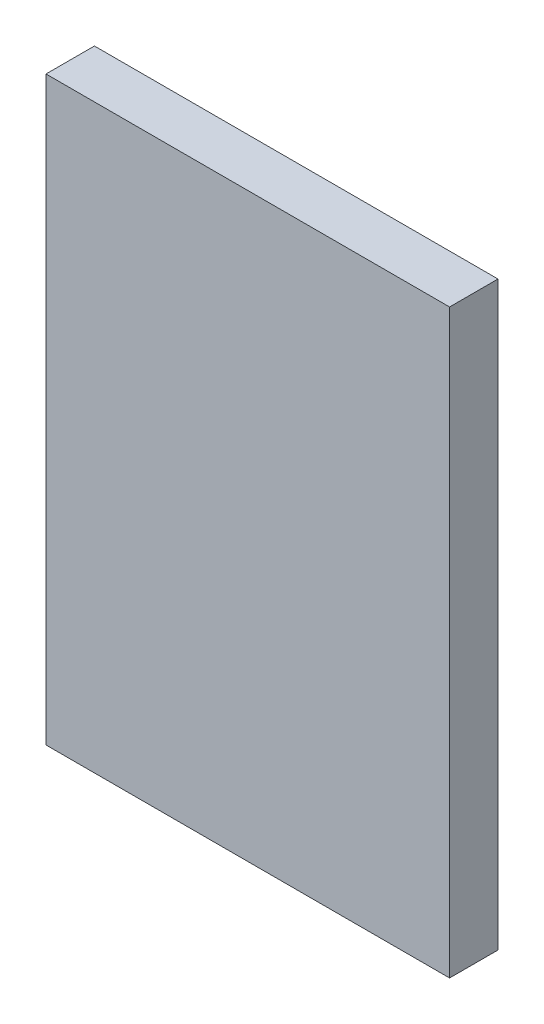
ISO-10303-21;
HEADER;
FILE_DESCRIPTION(('STEP AP214'),'2;1');
FILE_NAME('part.step','',(''),(''),'','','');
FILE_SCHEMA(('AUTOMOTIVE_DESIGN { 1 0 10303 214 1 1 1 1 }'));
ENDSEC;
DATA;
#1=APPLICATION_CONTEXT('core data for automotive mechanical design processes');
#2=APPLICATION_PROTOCOL_DEFINITION('international standard','automotive_design',2000,#1);
#3=PRODUCT_CONTEXT('',#1,'mechanical');
#4=PRODUCT('Part','Part','',(#3));
#5=PRODUCT_RELATED_PRODUCT_CATEGORY('part','',(#4));
#6=PRODUCT_DEFINITION_FORMATION('','',#4);
#7=PRODUCT_DEFINITION_CONTEXT('part definition',#1,'design');
#8=PRODUCT_DEFINITION('design','',#6,#7);
#9=PRODUCT_DEFINITION_SHAPE('','',#8);
#10=(LENGTH_UNIT() NAMED_UNIT(*) SI_UNIT(.MILLI.,.METRE.));
#11=(NAMED_UNIT(*) PLANE_ANGLE_UNIT() SI_UNIT($,.RADIAN.));
#12=(NAMED_UNIT(*) SI_UNIT($,.STERADIAN.) SOLID_ANGLE_UNIT());
#13=UNCERTAINTY_MEASURE_WITH_UNIT(LENGTH_MEASURE(1.E-05),#10,'distance_accuracy_value','');
#14=(GEOMETRIC_REPRESENTATION_CONTEXT(3) GLOBAL_UNCERTAINTY_ASSIGNED_CONTEXT((#13)) GLOBAL_UNIT_ASSIGNED_CONTEXT((#10,
#11,#12)) REPRESENTATION_CONTEXT('',''));
#15=CARTESIAN_POINT('',(0.,0.,0.));
#16=DIRECTION('',(0.,0.,1.));
#17=DIRECTION('',(1.,0.,0.));
#18=AXIS2_PLACEMENT_3D('',#15,#16,#17);
#19=CARTESIAN_POINT('',(-6.35162601626016,7.52032520325202,3.));
#20=DIRECTION('',(1.,0.,0.));
#21=DIRECTION('',(0.,1.,0.));
#22=AXIS2_PLACEMENT_3D('',#19,#20,#21);
#23=PLANE('',#22);
#24=DIRECTION('',(0.,-1.,0.));
#25=VECTOR('',#24,1.);
#26=CARTESIAN_POINT('',(-6.35162601626016,7.52032520325202,0.));
#27=LINE('',#26,#25);
#28=CARTESIAN_POINT('',(-6.35162601626016,7.52032520325202,0.));
#29=VERTEX_POINT('',#28);
#30=CARTESIAN_POINT('',(-6.35162601626016,-28.479674796748,0.));
#31=VERTEX_POINT('',#30);
#32=EDGE_CURVE('E96',#29,#31,#27,.T.);
#33=ORIENTED_EDGE('',*,*,#32,.T.);
#34=DIRECTION('',(0.,0.,-1.));
#35=VECTOR('',#34,1.);
#36=CARTESIAN_POINT('',(-6.35162601626016,-28.479674796748,3.));
#37=LINE('',#36,#35);
#38=CARTESIAN_POINT('',(-6.35162601626016,-28.479674796748,3.));
#39=VERTEX_POINT('',#38);
#40=EDGE_CURVE('E11',#39,#31,#37,.T.);
#41=ORIENTED_EDGE('',*,*,#40,.F.);
#42=DIRECTION('',(0.,-1.,0.));
#43=VECTOR('',#42,1.);
#44=CARTESIAN_POINT('',(-6.35162601626016,7.52032520325202,3.));
#45=LINE('',#44,#43);
#46=CARTESIAN_POINT('',(-6.35162601626016,7.52032520325202,3.));
#47=VERTEX_POINT('',#46);
#48=EDGE_CURVE('E84',#47,#39,#45,.T.);
#49=ORIENTED_EDGE('',*,*,#48,.F.);
#50=DIRECTION('',(0.,0.,-1.));
#51=VECTOR('',#50,1.);
#52=CARTESIAN_POINT('',(-6.35162601626016,7.52032520325202,3.));
#53=LINE('',#52,#51);
#54=EDGE_CURVE('E92',#47,#29,#53,.T.);
#55=ORIENTED_EDGE('',*,*,#54,.T.);
#56=EDGE_LOOP('',(#33,#41,#49,#55));
#57=FACE_BOUND('',#56,.T.);
#58=ADVANCED_FACE('F33',(#57),#23,.F.);
#59=CARTESIAN_POINT('',(-6.35162601626016,-28.479674796748,3.));
#60=DIRECTION('',(0.,1.,0.));
#61=DIRECTION('',(0.,0.,1.));
#62=AXIS2_PLACEMENT_3D('',#59,#60,#61);
#63=PLANE('',#62);
#64=DIRECTION('',(1.,0.,0.));
#65=VECTOR('',#64,1.);
#66=CARTESIAN_POINT('',(-6.35162601626016,-28.479674796748,0.));
#67=LINE('',#66,#65);
#68=CARTESIAN_POINT('',(18.6483739837398,-28.479674796748,0.));
#69=VERTEX_POINT('',#68);
#70=EDGE_CURVE('E88',#31,#69,#67,.T.);
#71=ORIENTED_EDGE('',*,*,#70,.T.);
#72=DIRECTION('',(0.,0.,-1.));
#73=VECTOR('',#72,1.);
#74=CARTESIAN_POINT('',(18.6483739837398,-28.479674796748,3.));
#75=LINE('',#74,#73);
#76=CARTESIAN_POINT('',(18.6483739837398,-28.479674796748,3.));
#77=VERTEX_POINT('',#76);
#78=EDGE_CURVE('E41',#77,#69,#75,.T.);
#79=ORIENTED_EDGE('',*,*,#78,.F.);
#80=DIRECTION('',(1.,0.,0.));
#81=VECTOR('',#80,1.);
#82=CARTESIAN_POINT('',(-6.35162601626016,-28.479674796748,3.));
#83=LINE('',#82,#81);
#84=EDGE_CURVE('E79',#39,#77,#83,.T.);
#85=ORIENTED_EDGE('',*,*,#84,.F.);
#86=ORIENTED_EDGE('',*,*,#40,.T.);
#87=EDGE_LOOP('',(#71,#79,#85,#86));
#88=FACE_BOUND('',#87,.T.);
#89=ADVANCED_FACE('F87',(#88),#63,.F.);
#90=CARTESIAN_POINT('',(18.6483739837398,7.52032520325202,3.));
#91=DIRECTION('',(-1.,0.,0.));
#92=DIRECTION('',(0.,-1.,0.));
#93=AXIS2_PLACEMENT_3D('',#90,#91,#92);
#94=PLANE('',#93);
#95=DIRECTION('',(0.,1.,0.));
#96=VECTOR('',#95,1.);
#97=CARTESIAN_POINT('',(18.6483739837398,7.52032520325202,0.));
#98=LINE('',#97,#96);
#99=CARTESIAN_POINT('',(18.6483739837398,7.52032520325202,0.));
#100=VERTEX_POINT('',#99);
#101=EDGE_CURVE('E66',#69,#100,#98,.T.);
#102=ORIENTED_EDGE('',*,*,#101,.T.);
#103=DIRECTION('',(0.,0.,-1.));
#104=VECTOR('',#103,1.);
#105=CARTESIAN_POINT('',(18.6483739837398,7.52032520325202,3.));
#106=LINE('',#105,#104);
#107=CARTESIAN_POINT('',(18.6483739837398,7.52032520325202,3.));
#108=VERTEX_POINT('',#107);
#109=EDGE_CURVE('E89',#108,#100,#106,.T.);
#110=ORIENTED_EDGE('',*,*,#109,.F.);
#111=DIRECTION('',(0.,1.,0.));
#112=VECTOR('',#111,1.);
#113=CARTESIAN_POINT('',(18.6483739837398,7.52032520325202,3.));
#114=LINE('',#113,#112);
#115=EDGE_CURVE('E82',#77,#108,#114,.T.);
#116=ORIENTED_EDGE('',*,*,#115,.F.);
#117=ORIENTED_EDGE('',*,*,#78,.T.);
#118=EDGE_LOOP('',(#102,#110,#116,#117));
#119=FACE_BOUND('',#118,.T.);
#120=ADVANCED_FACE('F90',(#119),#94,.F.);
#121=CARTESIAN_POINT('',(-6.35162601626016,7.52032520325202,3.));
#122=DIRECTION('',(0.,-1.,0.));
#123=DIRECTION('',(0.,0.,-1.));
#124=AXIS2_PLACEMENT_3D('',#121,#122,#123);
#125=PLANE('',#124);
#126=DIRECTION('',(-1.,0.,0.));
#127=VECTOR('',#126,1.);
#128=CARTESIAN_POINT('',(-6.35162601626016,7.52032520325202,0.));
#129=LINE('',#128,#127);
#130=EDGE_CURVE('E72',#100,#29,#129,.T.);
#131=ORIENTED_EDGE('',*,*,#130,.T.);
#132=ORIENTED_EDGE('',*,*,#54,.F.);
#133=DIRECTION('',(-1.,0.,0.));
#134=VECTOR('',#133,1.);
#135=CARTESIAN_POINT('',(-6.35162601626016,7.52032520325202,3.));
#136=LINE('',#135,#134);
#137=EDGE_CURVE('E49',#108,#47,#136,.T.);
#138=ORIENTED_EDGE('',*,*,#137,.F.);
#139=ORIENTED_EDGE('',*,*,#109,.T.);
#140=EDGE_LOOP('',(#131,#132,#138,#139));
#141=FACE_BOUND('',#140,.T.);
#142=ADVANCED_FACE('F103',(#141),#125,.F.);
#143=CARTESIAN_POINT('',(0.,0.,3.));
#144=DIRECTION('',(0.,0.,1.));
#145=DIRECTION('',(1.,0.,0.));
#146=AXIS2_PLACEMENT_3D('',#143,#144,#145);
#147=PLANE('',#146);
#148=ORIENTED_EDGE('',*,*,#48,.T.);
#149=ORIENTED_EDGE('',*,*,#84,.T.);
#150=ORIENTED_EDGE('',*,*,#115,.T.);
#151=ORIENTED_EDGE('',*,*,#137,.T.);
#152=EDGE_LOOP('',(#148,#149,#150,#151));
#153=FACE_BOUND('',#152,.T.);
#154=ADVANCED_FACE('F80',(#153),#147,.T.);
#155=CARTESIAN_POINT('',(0.,0.,0.));
#156=DIRECTION('',(0.,0.,1.));
#157=DIRECTION('',(1.,0.,0.));
#158=AXIS2_PLACEMENT_3D('',#155,#156,#157);
#159=PLANE('',#158);
#160=ORIENTED_EDGE('',*,*,#32,.F.);
#161=ORIENTED_EDGE('',*,*,#130,.F.);
#162=ORIENTED_EDGE('',*,*,#101,.F.);
#163=ORIENTED_EDGE('',*,*,#70,.F.);
#164=EDGE_LOOP('',(#160,#161,#162,#163));
#165=FACE_BOUND('',#164,.T.);
#166=ADVANCED_FACE('F106',(#165),#159,.F.);
#167=CLOSED_SHELL('',(#58,#89,#120,#142,#154,#166));
#168=MANIFOLD_SOLID_BREP('B2',#167);
#169=ADVANCED_BREP_SHAPE_REPRESENTATION('',(#18,#168),#14);
#170=SHAPE_DEFINITION_REPRESENTATION(#9,#169);
ENDSEC;
END-ISO-10303-21;
